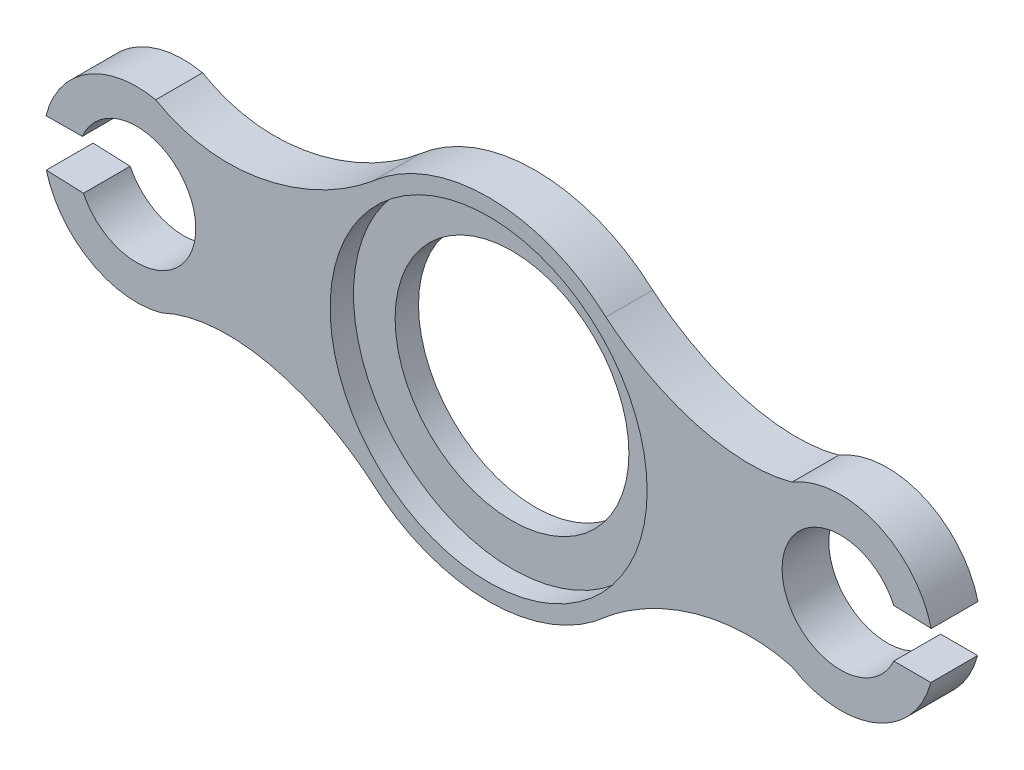
ISO-10303-21;
HEADER;
FILE_DESCRIPTION(('STEP AP214'),'2;1');
FILE_NAME('part.step','',(''),(''),'','','');
FILE_SCHEMA(('AUTOMOTIVE_DESIGN { 1 0 10303 214 1 1 1 1 }'));
ENDSEC;
DATA;
#1=APPLICATION_CONTEXT('core data for automotive mechanical design processes');
#2=APPLICATION_PROTOCOL_DEFINITION('international standard','automotive_design',2000,#1);
#3=PRODUCT_CONTEXT('',#1,'mechanical');
#4=PRODUCT('Part','Part','',(#3));
#5=PRODUCT_RELATED_PRODUCT_CATEGORY('part','',(#4));
#6=PRODUCT_DEFINITION_FORMATION('','',#4);
#7=PRODUCT_DEFINITION_CONTEXT('part definition',#1,'design');
#8=PRODUCT_DEFINITION('design','',#6,#7);
#9=PRODUCT_DEFINITION_SHAPE('','',#8);
#10=(LENGTH_UNIT() NAMED_UNIT(*) SI_UNIT(.MILLI.,.METRE.));
#11=(NAMED_UNIT(*) PLANE_ANGLE_UNIT() SI_UNIT($,.RADIAN.));
#12=(NAMED_UNIT(*) SI_UNIT($,.STERADIAN.) SOLID_ANGLE_UNIT());
#13=UNCERTAINTY_MEASURE_WITH_UNIT(LENGTH_MEASURE(1.E-05),#10,'distance_accuracy_value','');
#14=(GEOMETRIC_REPRESENTATION_CONTEXT(3) GLOBAL_UNCERTAINTY_ASSIGNED_CONTEXT((#13)) GLOBAL_UNIT_ASSIGNED_CONTEXT((#10,
#11,#12)) REPRESENTATION_CONTEXT('',''));
#15=CARTESIAN_POINT('',(0.,0.,0.));
#16=DIRECTION('',(0.,0.,1.));
#17=DIRECTION('',(1.,0.,0.));
#18=AXIS2_PLACEMENT_3D('',#15,#16,#17);
#19=CARTESIAN_POINT('',(-142.476147957956,-39.1815792815097,20.));
#20=CARTESIAN_POINT('',(-111.828209872409,-22.9866555733786,20.));
#21=CARTESIAN_POINT('',(-72.3927113897549,-35.5921951527222,20.));
#22=CARTESIAN_POINT('',(-47.9760875877328,-57.4566464006246,20.));
#23=B_SPLINE_CURVE_WITH_KNOTS('',3,(#19,#20,#21,#22),.UNSPECIFIED.,.F.,.F.,(4,4),(0.,1.),.UNSPECIFIED.);
#24=DIRECTION('',(0.,0.,-1.));
#25=VECTOR('',#24,1.);
#26=SURFACE_OF_LINEAR_EXTRUSION('',#23,#25);
#27=CARTESIAN_POINT('',(-142.476147957956,-39.1815792815097,0.));
#28=CARTESIAN_POINT('',(-111.828209872409,-22.9866555733786,0.));
#29=CARTESIAN_POINT('',(-72.3927113897549,-35.5921951527222,0.));
#30=CARTESIAN_POINT('',(-47.9760875877328,-57.4566464006246,0.));
#31=B_SPLINE_CURVE_WITH_KNOTS('',3,(#27,#28,#29,#30),.UNSPECIFIED.,.F.,.F.,(4,4),(0.,1.),.UNSPECIFIED.);
#32=CARTESIAN_POINT('',(-140.039484135201,-37.9628577080117,0.));
#33=VERTEX_POINT('',#32);
#34=CARTESIAN_POINT('',(-50.1742604774484,-55.5474102130187,0.));
#35=VERTEX_POINT('',#34);
#36=EDGE_CURVE('E515',#33,#35,#31,.T.);
#37=ORIENTED_EDGE('',*,*,#36,.T.);
#38=DIRECTION('',(0.,0.,-1.));
#39=VECTOR('',#38,1.);
#40=CARTESIAN_POINT('',(-50.1742604774484,-55.5474102130187,20.));
#41=LINE('',#40,#39);
#42=CARTESIAN_POINT('',(-50.1742604774484,-55.5474102130187,20.));
#43=VERTEX_POINT('',#42);
#44=EDGE_CURVE('E561',#43,#35,#41,.T.);
#45=ORIENTED_EDGE('',*,*,#44,.F.);
#46=CARTESIAN_POINT('',(-140.039484135201,-37.9628577080117,20.));
#47=VERTEX_POINT('',#46);
#48=EDGE_CURVE('E480',#47,#43,#23,.T.);
#49=ORIENTED_EDGE('',*,*,#48,.F.);
#50=DIRECTION('',(0.,0.,-1.));
#51=VECTOR('',#50,1.);
#52=CARTESIAN_POINT('',(-140.039484135201,-37.9628577080117,20.));
#53=LINE('',#52,#51);
#54=EDGE_CURVE('E227',#47,#33,#53,.T.);
#55=ORIENTED_EDGE('',*,*,#54,.T.);
#56=EDGE_LOOP('',(#37,#45,#49,#55));
#57=FACE_BOUND('',#56,.T.);
#58=ADVANCED_FACE('F217',(#57),#26,.F.);
#59=CARTESIAN_POINT('',(-142.348418469552,39.7931441766528,20.));
#60=CARTESIAN_POINT('',(-112.181206024007,22.0907474943355,20.));
#61=CARTESIAN_POINT('',(-72.1887918897733,36.2336965381562,20.));
#62=CARTESIAN_POINT('',(-47.9760875877328,57.4566464006246,20.));
#63=B_SPLINE_CURVE_WITH_KNOTS('',3,(#59,#60,#61,#62),.UNSPECIFIED.,.F.,.F.,(4,4),(0.,1.),.UNSPECIFIED.);
#64=DIRECTION('',(0.,0.,-1.));
#65=VECTOR('',#64,1.);
#66=SURFACE_OF_LINEAR_EXTRUSION('',#63,#65);
#67=CARTESIAN_POINT('',(-142.348418469552,39.7931441766528,0.));
#68=CARTESIAN_POINT('',(-112.181206024007,22.0907474943355,0.));
#69=CARTESIAN_POINT('',(-72.1887918897733,36.2336965381562,0.));
#70=CARTESIAN_POINT('',(-47.9760875877328,57.4566464006246,0.));
#71=B_SPLINE_CURVE_WITH_KNOTS('',3,(#67,#68,#69,#70),.UNSPECIFIED.,.F.,.F.,(4,4),(0.,1.),.UNSPECIFIED.);
#72=CARTESIAN_POINT('',(-142.348418469552,39.7931441766528,0.));
#73=VERTEX_POINT('',#72);
#74=CARTESIAN_POINT('',(-49.5314640660004,56.1213440975065,0.));
#75=VERTEX_POINT('',#74);
#76=EDGE_CURVE('E521',#73,#75,#71,.T.);
#77=ORIENTED_EDGE('',*,*,#76,.F.);
#78=DIRECTION('',(0.,0.,-1.));
#79=VECTOR('',#78,1.);
#80=CARTESIAN_POINT('',(-142.348418469552,39.7931441766528,20.));
#81=LINE('',#80,#79);
#82=CARTESIAN_POINT('',(-142.348418469552,39.7931441766528,20.));
#83=VERTEX_POINT('',#82);
#84=EDGE_CURVE('E556',#83,#73,#81,.T.);
#85=ORIENTED_EDGE('',*,*,#84,.F.);
#86=CARTESIAN_POINT('',(-49.5314640660004,56.1213440975065,20.));
#87=VERTEX_POINT('',#86);
#88=EDGE_CURVE('E486',#83,#87,#63,.T.);
#89=ORIENTED_EDGE('',*,*,#88,.T.);
#90=DIRECTION('',(0.,0.,-1.));
#91=VECTOR('',#90,1.);
#92=CARTESIAN_POINT('',(-49.5314640660004,56.1213440975065,20.));
#93=LINE('',#92,#91);
#94=EDGE_CURVE('E559',#87,#75,#93,.T.);
#95=ORIENTED_EDGE('',*,*,#94,.T.);
#96=EDGE_LOOP('',(#77,#85,#89,#95));
#97=FACE_BOUND('',#96,.T.);
#98=ADVANCED_FACE('F468',(#97),#66,.T.);
#99=CARTESIAN_POINT('',(-150.526231498372,0.638024791498974,20.));
#100=DIRECTION('',(0.,0.,-1.));
#101=DIRECTION('',(-1.,0.,0.));
#102=AXIS2_PLACEMENT_3D('',#99,#100,#101);
#103=CYLINDRICAL_SURFACE('',#102,40.);
#104=CARTESIAN_POINT('',(-150.526231498372,0.638024791498974,0.));
#105=DIRECTION('',(0.,0.,1.));
#106=DIRECTION('',(1.,0.,0.));
#107=AXIS2_PLACEMENT_3D('',#104,#105,#106);
#108=CIRCLE('',#107,40.);
#109=CARTESIAN_POINT('',(-189.319803444231,10.3878337989347,0.));
#110=VERTEX_POINT('',#109);
#111=EDGE_CURVE('E516',#110,#73,#108,.F.);
#112=ORIENTED_EDGE('',*,*,#111,.F.);
#113=DIRECTION('',(0.,0.,-1.));
#114=VECTOR('',#113,1.);
#115=CARTESIAN_POINT('',(-189.319803444231,10.3878337989347,20.));
#116=LINE('',#115,#114);
#117=CARTESIAN_POINT('',(-189.319803444231,10.3878337989347,20.));
#118=VERTEX_POINT('',#117);
#119=EDGE_CURVE('E553',#118,#110,#116,.T.);
#120=ORIENTED_EDGE('',*,*,#119,.F.);
#121=CARTESIAN_POINT('',(-150.526231498372,0.638024791498974,20.));
#122=DIRECTION('',(0.,0.,1.));
#123=DIRECTION('',(1.,0.,0.));
#124=AXIS2_PLACEMENT_3D('',#121,#122,#123);
#125=CIRCLE('',#124,40.);
#126=EDGE_CURVE('E498',#118,#83,#125,.F.);
#127=ORIENTED_EDGE('',*,*,#126,.T.);
#128=ORIENTED_EDGE('',*,*,#84,.T.);
#129=EDGE_LOOP('',(#112,#120,#127,#128));
#130=FACE_BOUND('',#129,.T.);
#131=ADVANCED_FACE('F473',(#130),#103,.T.);
#132=CARTESIAN_POINT('',(-0.0925829794748389,11.8644485594583,20.));
#133=DIRECTION('',(-0.00780315750142878,0.999969554903052,0.));
#134=DIRECTION('',(-0.999969554903052,-0.00780315750142878,0.));
#135=AXIS2_PLACEMENT_3D('',#132,#133,#134);
#136=PLANE('',#135);
#137=DIRECTION('',(0.999969554903052,0.00780315750142878,0.));
#138=VECTOR('',#137,1.);
#139=CARTESIAN_POINT('',(-0.0925829794748389,11.8644485594583,0.));
#140=LINE('',#139,#138);
#141=CARTESIAN_POINT('',(-173.788179778674,10.5090331945773,0.));
#142=VERTEX_POINT('',#141);
#143=EDGE_CURVE('E530',#110,#142,#140,.T.);
#144=ORIENTED_EDGE('',*,*,#143,.T.);
#145=DIRECTION('',(0.,0.,-1.));
#146=VECTOR('',#145,1.);
#147=CARTESIAN_POINT('',(-173.788179778674,10.5090331945773,20.));
#148=LINE('',#147,#146);
#149=CARTESIAN_POINT('',(-173.788179778674,10.5090331945773,20.));
#150=VERTEX_POINT('',#149);
#151=EDGE_CURVE('E549',#150,#142,#148,.T.);
#152=ORIENTED_EDGE('',*,*,#151,.F.);
#153=DIRECTION('',(0.999969554903052,0.00780315750142878,0.));
#154=VECTOR('',#153,1.);
#155=CARTESIAN_POINT('',(-0.0925829794748389,11.8644485594583,20.));
#156=LINE('',#155,#154);
#157=EDGE_CURVE('E499',#118,#150,#156,.T.);
#158=ORIENTED_EDGE('',*,*,#157,.F.);
#159=ORIENTED_EDGE('',*,*,#119,.T.);
#160=EDGE_LOOP('',(#144,#152,#158,#159));
#161=FACE_BOUND('',#160,.T.);
#162=ADVANCED_FACE('F625',(#161),#136,.F.);
#163=CARTESIAN_POINT('',(-150.526231498372,0.638024791498974,20.));
#164=DIRECTION('',(0.,0.,-1.));
#165=DIRECTION('',(-1.,0.,0.));
#166=AXIS2_PLACEMENT_3D('',#163,#164,#165);
#167=CYLINDRICAL_SURFACE('',#166,25.2696467068508);
#168=CARTESIAN_POINT('',(-150.526231498372,0.638024791498974,0.));
#169=DIRECTION('',(0.,0.,1.));
#170=DIRECTION('',(1.,0.,0.));
#171=AXIS2_PLACEMENT_3D('',#168,#169,#170);
#172=CIRCLE('',#171,25.2696467068508);
#173=CARTESIAN_POINT('',(-173.304176625628,-10.3036506043806,0.));
#174=VERTEX_POINT('',#173);
#175=EDGE_CURVE('E536',#142,#174,#172,.F.);
#176=ORIENTED_EDGE('',*,*,#175,.T.);
#177=DIRECTION('',(0.,0.,-1.));
#178=VECTOR('',#177,1.);
#179=CARTESIAN_POINT('',(-173.304176625628,-10.3036506043806,20.));
#180=LINE('',#179,#178);
#181=CARTESIAN_POINT('',(-173.304176625628,-10.3036506043806,20.));
#182=VERTEX_POINT('',#181);
#183=EDGE_CURVE('E546',#182,#174,#180,.T.);
#184=ORIENTED_EDGE('',*,*,#183,.F.);
#185=CARTESIAN_POINT('',(-150.526231498372,0.638024791498974,20.));
#186=DIRECTION('',(0.,0.,1.));
#187=DIRECTION('',(1.,0.,0.));
#188=AXIS2_PLACEMENT_3D('',#185,#186,#187);
#189=CIRCLE('',#188,25.2696467068508);
#190=EDGE_CURVE('E506',#150,#182,#189,.F.);
#191=ORIENTED_EDGE('',*,*,#190,.F.);
#192=ORIENTED_EDGE('',*,*,#151,.T.);
#193=EDGE_LOOP('',(#176,#184,#191,#192));
#194=FACE_BOUND('',#193,.T.);
#195=ADVANCED_FACE('F580',(#194),#167,.F.);
#196=CARTESIAN_POINT('',(-0.69309496509614,-17.2422006298218,20.));
#197=DIRECTION('',(0.0401651558367979,0.999193054547821,0.));
#198=DIRECTION('',(-0.999193054547822,0.0401651558367979,0.));
#199=AXIS2_PLACEMENT_3D('',#196,#197,#198);
#200=PLANE('',#199);
#201=DIRECTION('',(0.999193054547821,-0.0401651558367979,0.));
#202=VECTOR('',#201,1.);
#203=CARTESIAN_POINT('',(-0.69309496509614,-17.2422006298218,0.));
#204=LINE('',#203,#202);
#205=CARTESIAN_POINT('',(-189.176390414253,-9.66562581288157,0.));
#206=VERTEX_POINT('',#205);
#207=EDGE_CURVE('E540',#206,#174,#204,.T.);
#208=ORIENTED_EDGE('',*,*,#207,.F.);
#209=DIRECTION('',(0.,0.,-1.));
#210=VECTOR('',#209,1.);
#211=CARTESIAN_POINT('',(-189.176390414253,-9.66562581288157,20.));
#212=LINE('',#211,#210);
#213=CARTESIAN_POINT('',(-189.176390414253,-9.66562581288157,20.));
#214=VERTEX_POINT('',#213);
#215=EDGE_CURVE('E235',#214,#206,#212,.T.);
#216=ORIENTED_EDGE('',*,*,#215,.F.);
#217=DIRECTION('',(0.999193054547821,-0.0401651558367979,0.));
#218=VECTOR('',#217,1.);
#219=CARTESIAN_POINT('',(-0.69309496509614,-17.2422006298218,20.));
#220=LINE('',#219,#218);
#221=EDGE_CURVE('E509',#214,#182,#220,.T.);
#222=ORIENTED_EDGE('',*,*,#221,.T.);
#223=ORIENTED_EDGE('',*,*,#183,.T.);
#224=EDGE_LOOP('',(#208,#216,#222,#223));
#225=FACE_BOUND('',#224,.T.);
#226=ADVANCED_FACE('F577',(#225),#200,.T.);
#227=EDGE_CURVE('E512',#33,#206,#108,.F.);
#228=ORIENTED_EDGE('',*,*,#227,.F.);
#229=ORIENTED_EDGE('',*,*,#54,.F.);
#230=EDGE_CURVE('E487',#47,#214,#125,.F.);
#231=ORIENTED_EDGE('',*,*,#230,.T.);
#232=ORIENTED_EDGE('',*,*,#215,.T.);
#233=EDGE_LOOP('',(#228,#229,#231,#232));
#234=FACE_BOUND('',#233,.T.);
#235=ADVANCED_FACE('F572',(#234),#103,.T.);
#236=CARTESIAN_POINT('',(0.,0.,0.));
#237=DIRECTION('',(0.,0.,1.));
#238=DIRECTION('',(1.,0.,0.));
#239=AXIS2_PLACEMENT_3D('',#236,#237,#238);
#240=PLANE('',#239);
#241=ORIENTED_EDGE('',*,*,#227,.T.);
#242=ORIENTED_EDGE('',*,*,#207,.T.);
#243=ORIENTED_EDGE('',*,*,#175,.F.);
#244=ORIENTED_EDGE('',*,*,#143,.F.);
#245=ORIENTED_EDGE('',*,*,#111,.T.);
#246=ORIENTED_EDGE('',*,*,#76,.T.);
#247=CARTESIAN_POINT('',(0.,0.,0.));
#248=DIRECTION('',(0.,0.,1.));
#249=DIRECTION('',(1.,0.,0.));
#250=AXIS2_PLACEMENT_3D('',#247,#248,#249);
#251=CIRCLE('',#250,74.8529972401387);
#252=CARTESIAN_POINT('',(50.1742604774413,55.5474102130252,0.));
#253=VERTEX_POINT('',#252);
#254=EDGE_CURVE('E370',#253,#75,#251,.T.);
#255=ORIENTED_EDGE('',*,*,#254,.F.);
#256=CARTESIAN_POINT('',(142.476147957956,39.1815792815107,0.));
#257=CARTESIAN_POINT('',(111.82820987241,22.9866555733793,0.));
#258=CARTESIAN_POINT('',(72.3927113897551,35.5921951527227,0.));
#259=CARTESIAN_POINT('',(47.9760875877329,57.4566464006249,0.));
#260=B_SPLINE_CURVE_WITH_KNOTS('',3,(#256,#257,#258,#259),.UNSPECIFIED.,.F.,.F.,(4,4),(0.,1.),.UNSPECIFIED.);
#261=CARTESIAN_POINT('',(129.742096757546,34.1763038241057,0.));
#262=VERTEX_POINT('',#261);
#263=EDGE_CURVE('E420',#262,#253,#260,.T.);
#264=ORIENTED_EDGE('',*,*,#263,.F.);
#265=CARTESIAN_POINT('',(150.526231498316,1.00852215101906E-12,0.));
#266=DIRECTION('',(0.,0.,1.));
#267=DIRECTION('',(1.,0.,0.));
#268=AXIS2_PLACEMENT_3D('',#265,#266,#267);
#269=CIRCLE('',#268,40.);
#270=CARTESIAN_POINT('',(189.319803444175,9.74980900743701,0.));
#271=VERTEX_POINT('',#270);
#272=EDGE_CURVE('E337',#271,#262,#269,.T.);
#273=ORIENTED_EDGE('',*,*,#272,.F.);
#274=DIRECTION('',(0.999402601732537,-0.0345606662296391,0.));
#275=VECTOR('',#274,1.);
#276=CARTESIAN_POINT('',(173.304176625628,10.3036506043817,0.));
#277=LINE('',#276,#275);
#278=CARTESIAN_POINT('',(173.304176625628,10.3036506043817,0.));
#279=VERTEX_POINT('',#278);
#280=EDGE_CURVE('E321',#279,#271,#277,.T.);
#281=ORIENTED_EDGE('',*,*,#280,.F.);
#282=CARTESIAN_POINT('',(150.526231498316,1.00852215101906E-12,0.));
#283=DIRECTION('',(0.,0.,1.));
#284=DIRECTION('',(1.,0.,0.));
#285=AXIS2_PLACEMENT_3D('',#282,#283,#284);
#286=CIRCLE('',#285,25.);
#287=CARTESIAN_POINT('',(173.304176625628,-10.3036506043794,0.));
#288=VERTEX_POINT('',#287);
#289=EDGE_CURVE('E334',#279,#288,#286,.T.);
#290=ORIENTED_EDGE('',*,*,#289,.T.);
#291=DIRECTION('',(1.,0.,0.));
#292=VECTOR('',#291,1.);
#293=CARTESIAN_POINT('',(173.304176625628,-10.3036506043794,0.));
#294=LINE('',#293,#292);
#295=CARTESIAN_POINT('',(189.176390414197,-10.3036506043793,0.));
#296=VERTEX_POINT('',#295);
#297=EDGE_CURVE('E345',#288,#296,#294,.T.);
#298=ORIENTED_EDGE('',*,*,#297,.T.);
#299=CARTESIAN_POINT('',(129.742096757546,-34.176303824104,0.));
#300=VERTEX_POINT('',#299);
#301=EDGE_CURVE('E340',#300,#296,#269,.T.);
#302=ORIENTED_EDGE('',*,*,#301,.F.);
#303=CARTESIAN_POINT('',(142.476147957957,-39.1815792815088,0.));
#304=CARTESIAN_POINT('',(111.82820987241,-22.9866555733779,0.));
#305=CARTESIAN_POINT('',(72.3927113897556,-35.5921951527217,0.));
#306=CARTESIAN_POINT('',(47.9760875877337,-57.4566464006243,0.));
#307=B_SPLINE_CURVE_WITH_KNOTS('',3,(#303,#304,#305,#306),.UNSPECIFIED.,.F.,.F.,(4,4),(0.,1.),.UNSPECIFIED.);
#308=CARTESIAN_POINT('',(50.1742604774415,-55.547410213025,0.));
#309=VERTEX_POINT('',#308);
#310=EDGE_CURVE('E379',#300,#309,#307,.T.);
#311=ORIENTED_EDGE('',*,*,#310,.T.);
#312=EDGE_CURVE('E365',#35,#309,#251,.T.);
#313=ORIENTED_EDGE('',*,*,#312,.F.);
#314=ORIENTED_EDGE('',*,*,#36,.F.);
#315=EDGE_LOOP('',(#241,#242,#243,#244,#245,#246,#255,#264,#273,#281,#290,#298,#302,#311,#313,#314));
#316=FACE_BOUND('',#315,.T.);
#317=CARTESIAN_POINT('',(0.,0.,0.));
#318=DIRECTION('',(0.,0.,1.));
#319=DIRECTION('',(1.,0.,0.));
#320=AXIS2_PLACEMENT_3D('',#317,#318,#319);
#321=CIRCLE('',#320,50.);
#322=CARTESIAN_POINT('',(50.,0.,0.));
#323=VERTEX_POINT('',#322);
#324=EDGE_CURVE('E653',#323,#323,#321,.T.);
#325=ORIENTED_EDGE('',*,*,#324,.T.);
#326=EDGE_LOOP('',(#325));
#327=FACE_BOUND('',#326,.T.);
#328=ADVANCED_FACE('F331',(#316,#327),#240,.F.);
#329=CARTESIAN_POINT('',(0.,0.,20.));
#330=DIRECTION('',(0.,0.,1.));
#331=DIRECTION('',(1.,0.,0.));
#332=AXIS2_PLACEMENT_3D('',#329,#330,#331);
#333=PLANE('',#332);
#334=ORIENTED_EDGE('',*,*,#230,.F.);
#335=ORIENTED_EDGE('',*,*,#48,.T.);
#336=CARTESIAN_POINT('',(0.,0.,20.));
#337=DIRECTION('',(0.,0.,1.));
#338=DIRECTION('',(1.,0.,0.));
#339=AXIS2_PLACEMENT_3D('',#336,#337,#338);
#340=CIRCLE('',#339,74.8529972401387);
#341=CARTESIAN_POINT('',(50.1742604774415,-55.547410213025,20.));
#342=VERTEX_POINT('',#341);
#343=EDGE_CURVE('E380',#43,#342,#340,.T.);
#344=ORIENTED_EDGE('',*,*,#343,.T.);
#345=CARTESIAN_POINT('',(142.476147957957,-39.1815792815088,20.));
#346=CARTESIAN_POINT('',(111.82820987241,-22.9866555733779,20.));
#347=CARTESIAN_POINT('',(72.3927113897556,-35.5921951527217,20.));
#348=CARTESIAN_POINT('',(47.9760875877337,-57.4566464006243,20.));
#349=B_SPLINE_CURVE_WITH_KNOTS('',3,(#345,#346,#347,#348),.UNSPECIFIED.,.F.,.F.,(4,4),(0.,1.),.UNSPECIFIED.);
#350=CARTESIAN_POINT('',(129.742096757546,-34.176303824104,20.));
#351=VERTEX_POINT('',#350);
#352=EDGE_CURVE('E411',#351,#342,#349,.T.);
#353=ORIENTED_EDGE('',*,*,#352,.F.);
#354=CARTESIAN_POINT('',(150.526231498316,1.00852215101906E-12,20.));
#355=DIRECTION('',(0.,0.,1.));
#356=DIRECTION('',(1.,0.,0.));
#357=AXIS2_PLACEMENT_3D('',#354,#355,#356);
#358=CIRCLE('',#357,40.);
#359=CARTESIAN_POINT('',(189.176390414197,-10.3036506043793,20.));
#360=VERTEX_POINT('',#359);
#361=EDGE_CURVE('E349',#351,#360,#358,.T.);
#362=ORIENTED_EDGE('',*,*,#361,.T.);
#363=DIRECTION('',(1.,0.,0.));
#364=VECTOR('',#363,1.);
#365=CARTESIAN_POINT('',(173.304176625628,-10.3036506043794,20.));
#366=LINE('',#365,#364);
#367=CARTESIAN_POINT('',(173.304176625628,-10.3036506043794,20.));
#368=VERTEX_POINT('',#367);
#369=EDGE_CURVE('E388',#368,#360,#366,.T.);
#370=ORIENTED_EDGE('',*,*,#369,.F.);
#371=CARTESIAN_POINT('',(150.526231498316,1.00852215101906E-12,20.));
#372=DIRECTION('',(0.,0.,1.));
#373=DIRECTION('',(1.,0.,0.));
#374=AXIS2_PLACEMENT_3D('',#371,#372,#373);
#375=CIRCLE('',#374,25.);
#376=CARTESIAN_POINT('',(173.304176625628,10.3036506043817,20.));
#377=VERTEX_POINT('',#376);
#378=EDGE_CURVE('E326',#377,#368,#375,.T.);
#379=ORIENTED_EDGE('',*,*,#378,.F.);
#380=DIRECTION('',(0.999402601732537,-0.0345606662296391,0.));
#381=VECTOR('',#380,1.);
#382=CARTESIAN_POINT('',(173.304176625628,10.3036506043817,20.));
#383=LINE('',#382,#381);
#384=CARTESIAN_POINT('',(189.319803444175,9.74980900743701,20.));
#385=VERTEX_POINT('',#384);
#386=EDGE_CURVE('E323',#377,#385,#383,.T.);
#387=ORIENTED_EDGE('',*,*,#386,.T.);
#388=CARTESIAN_POINT('',(129.742096757546,34.1763038241057,20.));
#389=VERTEX_POINT('',#388);
#390=EDGE_CURVE('E384',#385,#389,#358,.T.);
#391=ORIENTED_EDGE('',*,*,#390,.T.);
#392=CARTESIAN_POINT('',(142.476147957956,39.1815792815107,20.));
#393=CARTESIAN_POINT('',(111.82820987241,22.9866555733793,20.));
#394=CARTESIAN_POINT('',(72.3927113897551,35.5921951527227,20.));
#395=CARTESIAN_POINT('',(47.9760875877329,57.4566464006249,20.));
#396=B_SPLINE_CURVE_WITH_KNOTS('',3,(#392,#393,#394,#395),.UNSPECIFIED.,.F.,.F.,(4,4),(0.,1.),.UNSPECIFIED.);
#397=CARTESIAN_POINT('',(50.1742604774413,55.5474102130252,20.));
#398=VERTEX_POINT('',#397);
#399=EDGE_CURVE('E419',#389,#398,#396,.T.);
#400=ORIENTED_EDGE('',*,*,#399,.T.);
#401=EDGE_CURVE('E376',#398,#87,#340,.T.);
#402=ORIENTED_EDGE('',*,*,#401,.T.);
#403=ORIENTED_EDGE('',*,*,#88,.F.);
#404=ORIENTED_EDGE('',*,*,#126,.F.);
#405=ORIENTED_EDGE('',*,*,#157,.T.);
#406=ORIENTED_EDGE('',*,*,#190,.T.);
#407=ORIENTED_EDGE('',*,*,#221,.F.);
#408=EDGE_LOOP('',(#334,#335,#344,#353,#362,#370,#379,#387,#391,#400,#402,#403,#404,#405,#406,#407));
#409=FACE_BOUND('',#408,.T.);
#410=CARTESIAN_POINT('',(0.,0.,20.));
#411=DIRECTION('',(0.,0.,1.));
#412=DIRECTION('',(1.,0.,0.));
#413=AXIS2_PLACEMENT_3D('',#410,#411,#412);
#414=CIRCLE('',#413,67.8);
#415=CARTESIAN_POINT('',(67.8,0.,20.));
#416=VERTEX_POINT('',#415);
#417=EDGE_CURVE('E361',#416,#416,#414,.T.);
#418=ORIENTED_EDGE('',*,*,#417,.F.);
#419=EDGE_LOOP('',(#418));
#420=FACE_BOUND('',#419,.T.);
#421=ADVANCED_FACE('F407',(#409,#420),#333,.T.);
#422=CARTESIAN_POINT('',(173.304176625628,-10.3036506043794,20.));
#423=DIRECTION('',(0.,1.,0.));
#424=DIRECTION('',(-1.,0.,0.));
#425=AXIS2_PLACEMENT_3D('',#422,#423,#424);
#426=PLANE('',#425);
#427=ORIENTED_EDGE('',*,*,#297,.F.);
#428=DIRECTION('',(0.,0.,-1.));
#429=VECTOR('',#428,1.);
#430=CARTESIAN_POINT('',(173.304176625628,-10.3036506043794,20.));
#431=LINE('',#430,#429);
#432=EDGE_CURVE('E312',#368,#288,#431,.T.);
#433=ORIENTED_EDGE('',*,*,#432,.F.);
#434=ORIENTED_EDGE('',*,*,#369,.T.);
#435=DIRECTION('',(0.,0.,-1.));
#436=VECTOR('',#435,1.);
#437=CARTESIAN_POINT('',(189.176390414197,-10.3036506043793,20.));
#438=LINE('',#437,#436);
#439=EDGE_CURVE('E356',#360,#296,#438,.T.);
#440=ORIENTED_EDGE('',*,*,#439,.T.);
#441=EDGE_LOOP('',(#427,#433,#434,#440));
#442=FACE_BOUND('',#441,.T.);
#443=ADVANCED_FACE('F403',(#442),#426,.T.);
#444=CARTESIAN_POINT('',(150.526231498316,1.00852215101906E-12,20.));
#445=DIRECTION('',(0.,0.,-1.));
#446=DIRECTION('',(-1.,0.,0.));
#447=AXIS2_PLACEMENT_3D('',#444,#445,#446);
#448=CYLINDRICAL_SURFACE('',#447,25.);
#449=ORIENTED_EDGE('',*,*,#289,.F.);
#450=DIRECTION('',(0.,0.,-1.));
#451=VECTOR('',#450,1.);
#452=CARTESIAN_POINT('',(173.304176625628,10.3036506043817,20.));
#453=LINE('',#452,#451);
#454=EDGE_CURVE('E318',#377,#279,#453,.T.);
#455=ORIENTED_EDGE('',*,*,#454,.F.);
#456=ORIENTED_EDGE('',*,*,#378,.T.);
#457=ORIENTED_EDGE('',*,*,#432,.T.);
#458=EDGE_LOOP('',(#449,#455,#456,#457));
#459=FACE_BOUND('',#458,.T.);
#460=ADVANCED_FACE('F343',(#459),#448,.F.);
#461=CARTESIAN_POINT('',(173.304176625628,10.3036506043817,20.));
#462=DIRECTION('',(0.0345606662296391,0.999402601732537,0.));
#463=DIRECTION('',(-0.999402601732537,0.0345606662296391,0.));
#464=AXIS2_PLACEMENT_3D('',#461,#462,#463);
#465=PLANE('',#464);
#466=ORIENTED_EDGE('',*,*,#280,.T.);
#467=DIRECTION('',(0.,0.,-1.));
#468=VECTOR('',#467,1.);
#469=CARTESIAN_POINT('',(189.319803444175,9.74980900743701,20.));
#470=LINE('',#469,#468);
#471=EDGE_CURVE('E359',#385,#271,#470,.T.);
#472=ORIENTED_EDGE('',*,*,#471,.F.);
#473=ORIENTED_EDGE('',*,*,#386,.F.);
#474=ORIENTED_EDGE('',*,*,#454,.T.);
#475=EDGE_LOOP('',(#466,#472,#473,#474));
#476=FACE_BOUND('',#475,.T.);
#477=ADVANCED_FACE('F219',(#476),#465,.F.);
#478=CARTESIAN_POINT('',(150.526231498316,1.00852215101906E-12,20.));
#479=DIRECTION('',(0.,0.,-1.));
#480=DIRECTION('',(-1.,0.,0.));
#481=AXIS2_PLACEMENT_3D('',#478,#479,#480);
#482=CYLINDRICAL_SURFACE('',#481,40.);
#483=ORIENTED_EDGE('',*,*,#361,.F.);
#484=DIRECTION('',(0.,0.,-1.));
#485=VECTOR('',#484,1.);
#486=CARTESIAN_POINT('',(129.742096757546,-34.176303824104,20.));
#487=LINE('',#486,#485);
#488=EDGE_CURVE('E374',#351,#300,#487,.T.);
#489=ORIENTED_EDGE('',*,*,#488,.T.);
#490=ORIENTED_EDGE('',*,*,#301,.T.);
#491=ORIENTED_EDGE('',*,*,#439,.F.);
#492=EDGE_LOOP('',(#483,#489,#490,#491));
#493=FACE_BOUND('',#492,.T.);
#494=ADVANCED_FACE('F399',(#493),#482,.T.);
#495=ORIENTED_EDGE('',*,*,#272,.T.);
#496=DIRECTION('',(0.,0.,-1.));
#497=VECTOR('',#496,1.);
#498=CARTESIAN_POINT('',(129.742096757546,34.1763038241057,20.));
#499=LINE('',#498,#497);
#500=EDGE_CURVE('E596',#389,#262,#499,.T.);
#501=ORIENTED_EDGE('',*,*,#500,.F.);
#502=ORIENTED_EDGE('',*,*,#390,.F.);
#503=ORIENTED_EDGE('',*,*,#471,.T.);
#504=EDGE_LOOP('',(#495,#501,#502,#503));
#505=FACE_BOUND('',#504,.T.);
#506=ADVANCED_FACE('F447',(#505),#482,.T.);
#507=DIRECTION('',(0.,0.,-1.));
#508=VECTOR('',#507,1.);
#509=SURFACE_OF_LINEAR_EXTRUSION('',#349,#508);
#510=ORIENTED_EDGE('',*,*,#310,.F.);
#511=ORIENTED_EDGE('',*,*,#488,.F.);
#512=ORIENTED_EDGE('',*,*,#352,.T.);
#513=DIRECTION('',(0.,0.,-1.));
#514=VECTOR('',#513,1.);
#515=CARTESIAN_POINT('',(50.1742604774415,-55.547410213025,20.));
#516=LINE('',#515,#514);
#517=EDGE_CURVE('E425',#342,#309,#516,.T.);
#518=ORIENTED_EDGE('',*,*,#517,.T.);
#519=EDGE_LOOP('',(#510,#511,#512,#518));
#520=FACE_BOUND('',#519,.T.);
#521=ADVANCED_FACE('F442',(#520),#509,.T.);
#522=DIRECTION('',(0.,0.,-1.));
#523=VECTOR('',#522,1.);
#524=SURFACE_OF_LINEAR_EXTRUSION('',#396,#523);
#525=ORIENTED_EDGE('',*,*,#263,.T.);
#526=DIRECTION('',(0.,0.,-1.));
#527=VECTOR('',#526,1.);
#528=CARTESIAN_POINT('',(50.1742604774413,55.5474102130252,20.));
#529=LINE('',#528,#527);
#530=EDGE_CURVE('E598',#398,#253,#529,.T.);
#531=ORIENTED_EDGE('',*,*,#530,.F.);
#532=ORIENTED_EDGE('',*,*,#399,.F.);
#533=ORIENTED_EDGE('',*,*,#500,.T.);
#534=EDGE_LOOP('',(#525,#531,#532,#533));
#535=FACE_BOUND('',#534,.T.);
#536=ADVANCED_FACE('F446',(#535),#524,.F.);
#537=CARTESIAN_POINT('',(0.,0.,20.));
#538=DIRECTION('',(0.,0.,-1.));
#539=DIRECTION('',(-1.,0.,0.));
#540=AXIS2_PLACEMENT_3D('',#537,#538,#539);
#541=CYLINDRICAL_SURFACE('',#540,67.8);
#542=CARTESIAN_POINT('',(0.,0.,10.));
#543=DIRECTION('',(0.,0.,1.));
#544=DIRECTION('',(1.,0.,0.));
#545=AXIS2_PLACEMENT_3D('',#542,#543,#544);
#546=CIRCLE('',#545,67.8);
#547=CARTESIAN_POINT('',(67.8,0.,10.));
#548=VERTEX_POINT('',#547);
#549=EDGE_CURVE('E12',#548,#548,#546,.T.);
#550=ORIENTED_EDGE('',*,*,#549,.F.);
#551=EDGE_LOOP('',(#550));
#552=FACE_BOUND('',#551,.T.);
#553=ORIENTED_EDGE('',*,*,#417,.T.);
#554=EDGE_LOOP('',(#553));
#555=FACE_BOUND('',#554,.T.);
#556=ADVANCED_FACE('F449',(#552,#555),#541,.F.);
#557=CARTESIAN_POINT('',(0.,0.,20.));
#558=DIRECTION('',(0.,0.,-1.));
#559=DIRECTION('',(-1.,0.,0.));
#560=AXIS2_PLACEMENT_3D('',#557,#558,#559);
#561=CYLINDRICAL_SURFACE('',#560,74.8529972401387);
#562=ORIENTED_EDGE('',*,*,#343,.F.);
#563=ORIENTED_EDGE('',*,*,#44,.T.);
#564=ORIENTED_EDGE('',*,*,#312,.T.);
#565=ORIENTED_EDGE('',*,*,#517,.F.);
#566=EDGE_LOOP('',(#562,#563,#564,#565));
#567=FACE_BOUND('',#566,.T.);
#568=ADVANCED_FACE('F452',(#567),#561,.T.);
#569=ORIENTED_EDGE('',*,*,#94,.F.);
#570=ORIENTED_EDGE('',*,*,#401,.F.);
#571=ORIENTED_EDGE('',*,*,#530,.T.);
#572=ORIENTED_EDGE('',*,*,#254,.T.);
#573=EDGE_LOOP('',(#569,#570,#571,#572));
#574=FACE_BOUND('',#573,.T.);
#575=ADVANCED_FACE('F455',(#574),#561,.T.);
#576=CARTESIAN_POINT('',(0.,0.,10.));
#577=DIRECTION('',(0.,0.,-1.));
#578=DIRECTION('',(-1.,0.,0.));
#579=AXIS2_PLACEMENT_3D('',#576,#577,#578);
#580=CYLINDRICAL_SURFACE('',#579,50.);
#581=CARTESIAN_POINT('',(0.,0.,10.));
#582=DIRECTION('',(0.,0.,1.));
#583=DIRECTION('',(1.,0.,0.));
#584=AXIS2_PLACEMENT_3D('',#581,#582,#583);
#585=CIRCLE('',#584,50.);
#586=CARTESIAN_POINT('',(50.,0.,10.));
#587=VERTEX_POINT('',#586);
#588=EDGE_CURVE('E341',#587,#587,#585,.T.);
#589=ORIENTED_EDGE('',*,*,#588,.T.);
#590=EDGE_LOOP('',(#589));
#591=FACE_BOUND('',#590,.T.);
#592=ORIENTED_EDGE('',*,*,#324,.F.);
#593=EDGE_LOOP('',(#592));
#594=FACE_BOUND('',#593,.T.);
#595=ADVANCED_FACE('F454',(#591,#594),#580,.F.);
#596=CARTESIAN_POINT('',(0.,0.,10.));
#597=DIRECTION('',(0.,0.,1.));
#598=DIRECTION('',(1.,0.,0.));
#599=AXIS2_PLACEMENT_3D('',#596,#597,#598);
#600=PLANE('',#599);
#601=ORIENTED_EDGE('',*,*,#588,.F.);
#602=EDGE_LOOP('',(#601));
#603=FACE_BOUND('',#602,.T.);
#604=ORIENTED_EDGE('',*,*,#549,.T.);
#605=EDGE_LOOP('',(#604));
#606=FACE_BOUND('',#605,.T.);
#607=ADVANCED_FACE('F642',(#603,#606),#600,.T.);
#608=CLOSED_SHELL('',(#58,#98,#131,#162,#195,#226,#235,#328,#421,#443,#460,#477,#494,#506,#521,
#536,#556,#568,#575,#595,#607));
#609=MANIFOLD_SOLID_BREP('B2',#608);
#610=ADVANCED_BREP_SHAPE_REPRESENTATION('',(#18,#609),#14);
#611=SHAPE_DEFINITION_REPRESENTATION(#9,#610);
ENDSEC;
END-ISO-10303-21;
